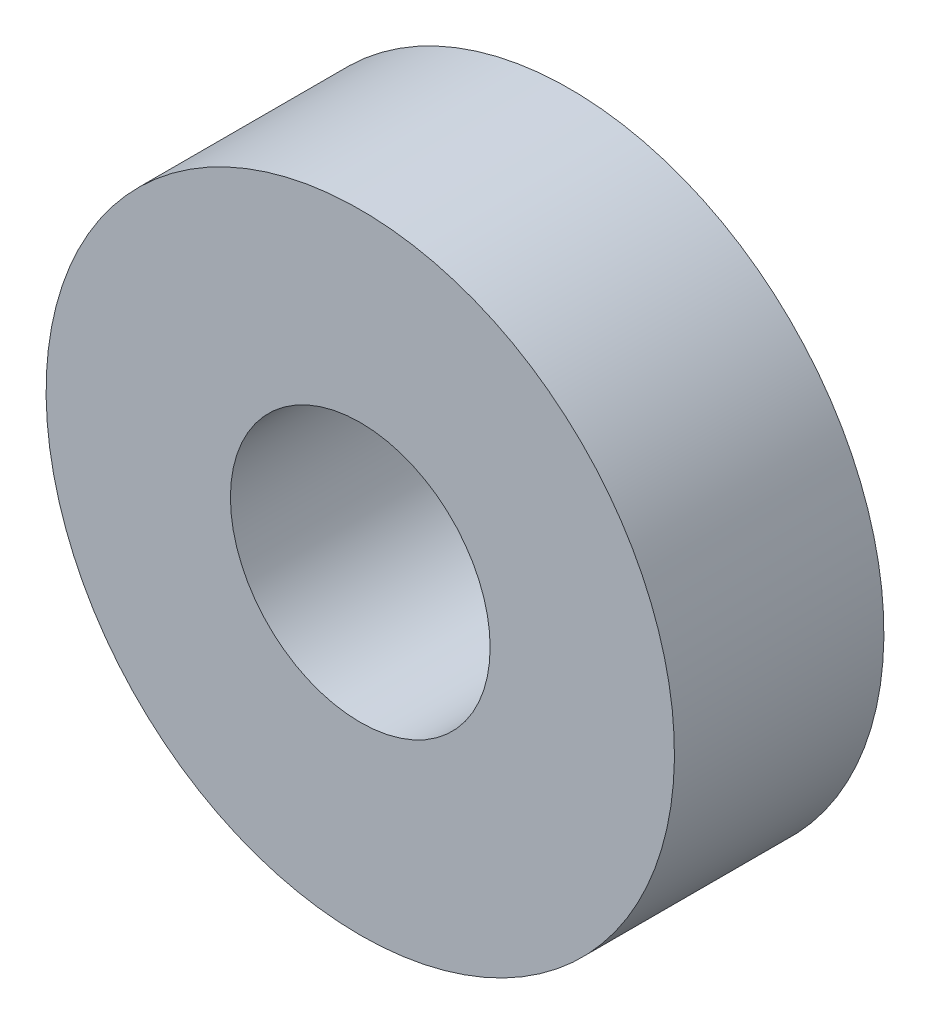
ISO-10303-21;
HEADER;
FILE_DESCRIPTION(('STEP AP214'),'2;1');
FILE_NAME('part.step','',(''),(''),'','','');
FILE_SCHEMA(('AUTOMOTIVE_DESIGN { 1 0 10303 214 1 1 1 1 }'));
ENDSEC;
DATA;
#1=APPLICATION_CONTEXT('core data for automotive mechanical design processes');
#2=APPLICATION_PROTOCOL_DEFINITION('international standard','automotive_design',2000,#1);
#3=PRODUCT_CONTEXT('',#1,'mechanical');
#4=PRODUCT('Part','Part','',(#3));
#5=PRODUCT_RELATED_PRODUCT_CATEGORY('part','',(#4));
#6=PRODUCT_DEFINITION_FORMATION('','',#4);
#7=PRODUCT_DEFINITION_CONTEXT('part definition',#1,'design');
#8=PRODUCT_DEFINITION('design','',#6,#7);
#9=PRODUCT_DEFINITION_SHAPE('','',#8);
#10=(LENGTH_UNIT() NAMED_UNIT(*) SI_UNIT(.MILLI.,.METRE.));
#11=(NAMED_UNIT(*) PLANE_ANGLE_UNIT() SI_UNIT($,.RADIAN.));
#12=(NAMED_UNIT(*) SI_UNIT($,.STERADIAN.) SOLID_ANGLE_UNIT());
#13=UNCERTAINTY_MEASURE_WITH_UNIT(LENGTH_MEASURE(1.E-05),#10,'distance_accuracy_value','');
#14=(GEOMETRIC_REPRESENTATION_CONTEXT(3) GLOBAL_UNCERTAINTY_ASSIGNED_CONTEXT((#13)) GLOBAL_UNIT_ASSIGNED_CONTEXT((#10,
#11,#12)) REPRESENTATION_CONTEXT('',''));
#15=CARTESIAN_POINT('',(0.,0.,0.));
#16=DIRECTION('',(0.,0.,1.));
#17=DIRECTION('',(1.,0.,0.));
#18=AXIS2_PLACEMENT_3D('',#15,#16,#17);
#19=CARTESIAN_POINT('',(-69.9999843245698,14.1421356237307,37.6381936628096));
#20=DIRECTION('',(0.,0.,-1.));
#21=DIRECTION('',(-1.,0.,0.));
#22=AXIS2_PLACEMENT_3D('',#19,#20,#21);
#23=CYLINDRICAL_SURFACE('',#22,7.5);
#24=CARTESIAN_POINT('',(-69.9999843245698,14.1421356237307,16.4249902272132));
#25=DIRECTION('',(0.,0.,1.));
#26=DIRECTION('',(0.,-1.,0.));
#27=AXIS2_PLACEMENT_3D('',#24,#25,#26);
#28=CIRCLE('',#27,7.5);
#29=CARTESIAN_POINT('',(-69.9999843245698,6.64213562373068,16.4249902272132));
#30=VERTEX_POINT('',#29);
#31=EDGE_CURVE('E11',#30,#30,#28,.T.);
#32=ORIENTED_EDGE('',*,*,#31,.F.);
#33=EDGE_LOOP('',(#32));
#34=FACE_BOUND('',#33,.T.);
#35=CARTESIAN_POINT('',(-69.9999843245698,14.1421356237307,11.4249902272132));
#36=DIRECTION('',(0.,0.,1.));
#37=DIRECTION('',(0.,-1.,0.));
#38=AXIS2_PLACEMENT_3D('',#35,#36,#37);
#39=CIRCLE('',#38,7.5);
#40=CARTESIAN_POINT('',(-69.9999843245698,6.64213562373068,11.4249902272132));
#41=VERTEX_POINT('',#40);
#42=EDGE_CURVE('E38',#41,#41,#39,.T.);
#43=ORIENTED_EDGE('',*,*,#42,.T.);
#44=EDGE_LOOP('',(#43));
#45=FACE_BOUND('',#44,.T.);
#46=ADVANCED_FACE('F32',(#34,#45),#23,.T.);
#47=CARTESIAN_POINT('',(-82.4999848245803,379.559772868199,16.4249902272119));
#48=DIRECTION('',(0.,0.,1.));
#49=DIRECTION('',(0.,-1.,0.));
#50=AXIS2_PLACEMENT_3D('',#47,#48,#49);
#51=PLANE('',#50);
#52=CARTESIAN_POINT('',(-69.9999843245698,14.1421356237307,16.4249902272132));
#53=DIRECTION('',(0.,0.,1.));
#54=DIRECTION('',(0.,-1.,0.));
#55=AXIS2_PLACEMENT_3D('',#52,#53,#54);
#56=CIRCLE('',#55,3.1);
#57=CARTESIAN_POINT('',(-69.9999843245698,11.0421356237307,16.4249902272132));
#58=VERTEX_POINT('',#57);
#59=EDGE_CURVE('E46',#58,#58,#56,.F.);
#60=ORIENTED_EDGE('',*,*,#59,.T.);
#61=EDGE_LOOP('',(#60));
#62=FACE_BOUND('',#61,.T.);
#63=ORIENTED_EDGE('',*,*,#31,.T.);
#64=EDGE_LOOP('',(#63));
#65=FACE_BOUND('',#64,.T.);
#66=ADVANCED_FACE('F52',(#62,#65),#51,.T.);
#67=CARTESIAN_POINT('',(-82.4999848245803,379.559772868199,11.4249902272119));
#68=DIRECTION('',(0.,0.,1.));
#69=DIRECTION('',(0.,-1.,0.));
#70=AXIS2_PLACEMENT_3D('',#67,#68,#69);
#71=PLANE('',#70);
#72=CARTESIAN_POINT('',(-69.9999843245698,14.1421356237307,11.4249902272132));
#73=DIRECTION('',(0.,0.,-1.));
#74=DIRECTION('',(0.,1.,0.));
#75=AXIS2_PLACEMENT_3D('',#72,#73,#74);
#76=CIRCLE('',#75,3.1);
#77=CARTESIAN_POINT('',(-69.9999843245698,17.2421356237307,11.4249902272132));
#78=VERTEX_POINT('',#77);
#79=EDGE_CURVE('E42',#78,#78,#76,.T.);
#80=ORIENTED_EDGE('',*,*,#79,.F.);
#81=EDGE_LOOP('',(#80));
#82=FACE_BOUND('',#81,.T.);
#83=ORIENTED_EDGE('',*,*,#42,.F.);
#84=EDGE_LOOP('',(#83));
#85=FACE_BOUND('',#84,.T.);
#86=ADVANCED_FACE('F57',(#82,#85),#71,.F.);
#87=CARTESIAN_POINT('',(-69.9999843245698,14.1421356237307,16.4259902272133));
#88=DIRECTION('',(0.,0.,-1.));
#89=DIRECTION('',(0.,1.,0.));
#90=AXIS2_PLACEMENT_3D('',#87,#88,#89);
#91=CYLINDRICAL_SURFACE('',#90,3.1);
#92=ORIENTED_EDGE('',*,*,#59,.F.);
#93=EDGE_LOOP('',(#92));
#94=FACE_BOUND('',#93,.T.);
#95=ORIENTED_EDGE('',*,*,#79,.T.);
#96=EDGE_LOOP('',(#95));
#97=FACE_BOUND('',#96,.T.);
#98=ADVANCED_FACE('F54',(#94,#97),#91,.F.);
#99=CLOSED_SHELL('',(#46,#66,#86,#98));
#100=MANIFOLD_SOLID_BREP('B2',#99);
#101=ADVANCED_BREP_SHAPE_REPRESENTATION('',(#18,#100),#14);
#102=SHAPE_DEFINITION_REPRESENTATION(#9,#101);
ENDSEC;
END-ISO-10303-21;
